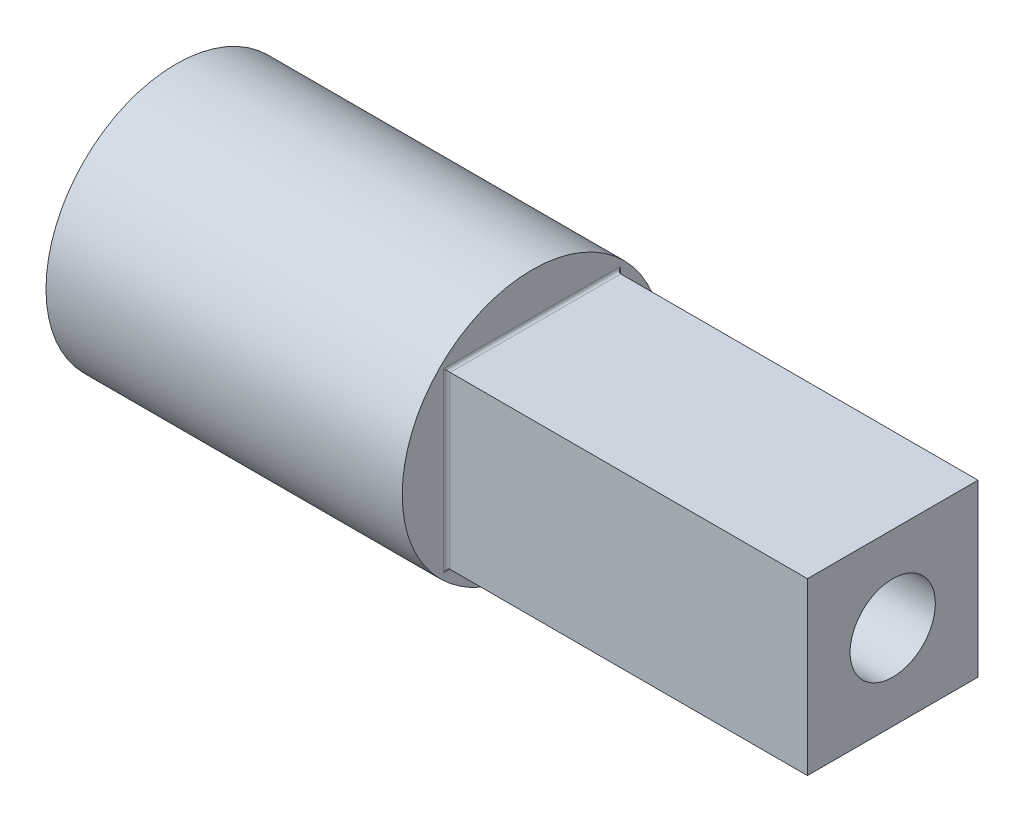
ISO-10303-21;
HEADER;
FILE_DESCRIPTION(('STEP AP214'),'2;1');
FILE_NAME('part.step','',(''),(''),'','','');
FILE_SCHEMA(('AUTOMOTIVE_DESIGN { 1 0 10303 214 1 1 1 1 }'));
ENDSEC;
DATA;
#1=APPLICATION_CONTEXT('core data for automotive mechanical design processes');
#2=APPLICATION_PROTOCOL_DEFINITION('international standard','automotive_design',2000,#1);
#3=PRODUCT_CONTEXT('',#1,'mechanical');
#4=PRODUCT('Part','Part','',(#3));
#5=PRODUCT_RELATED_PRODUCT_CATEGORY('part','',(#4));
#6=PRODUCT_DEFINITION_FORMATION('','',#4);
#7=PRODUCT_DEFINITION_CONTEXT('part definition',#1,'design');
#8=PRODUCT_DEFINITION('design','',#6,#7);
#9=PRODUCT_DEFINITION_SHAPE('','',#8);
#10=(LENGTH_UNIT() NAMED_UNIT(*) SI_UNIT(.MILLI.,.METRE.));
#11=(NAMED_UNIT(*) PLANE_ANGLE_UNIT() SI_UNIT($,.RADIAN.));
#12=(NAMED_UNIT(*) SI_UNIT($,.STERADIAN.) SOLID_ANGLE_UNIT());
#13=UNCERTAINTY_MEASURE_WITH_UNIT(LENGTH_MEASURE(1.E-05),#10,'distance_accuracy_value','');
#14=(GEOMETRIC_REPRESENTATION_CONTEXT(3) GLOBAL_UNCERTAINTY_ASSIGNED_CONTEXT((#13)) GLOBAL_UNIT_ASSIGNED_CONTEXT((#10,
#11,#12)) REPRESENTATION_CONTEXT('',''));
#15=CARTESIAN_POINT('',(0.,0.,0.));
#16=DIRECTION('',(0.,0.,1.));
#17=DIRECTION('',(1.,0.,0.));
#18=AXIS2_PLACEMENT_3D('',#15,#16,#17);
#19=CARTESIAN_POINT('',(87.72,0.,0.));
#20=DIRECTION('',(-1.,0.,0.));
#21=DIRECTION('',(0.,0.,1.));
#22=AXIS2_PLACEMENT_3D('',#19,#20,#21);
#23=CYLINDRICAL_SURFACE('',#22,32.);
#24=CARTESIAN_POINT('',(87.72,0.,0.));
#25=DIRECTION('',(1.,0.,0.));
#26=DIRECTION('',(0.,0.,-1.));
#27=AXIS2_PLACEMENT_3D('',#24,#25,#26);
#28=CIRCLE('',#27,32.);
#29=CARTESIAN_POINT('',(87.72,0.,-32.));
#30=VERTEX_POINT('',#29);
#31=EDGE_CURVE('E121',#30,#30,#28,.T.);
#32=ORIENTED_EDGE('',*,*,#31,.F.);
#33=EDGE_LOOP('',(#32));
#34=FACE_BOUND('',#33,.T.);
#35=CARTESIAN_POINT('',(0.,0.,0.));
#36=DIRECTION('',(1.,0.,0.));
#37=DIRECTION('',(0.,0.,-1.));
#38=AXIS2_PLACEMENT_3D('',#35,#36,#37);
#39=CIRCLE('',#38,32.);
#40=CARTESIAN_POINT('',(0.,0.,-32.));
#41=VERTEX_POINT('',#40);
#42=EDGE_CURVE('E116',#41,#41,#39,.T.);
#43=ORIENTED_EDGE('',*,*,#42,.T.);
#44=EDGE_LOOP('',(#43));
#45=FACE_BOUND('',#44,.T.);
#46=ADVANCED_FACE('F39',(#34,#45),#23,.T.);
#47=CARTESIAN_POINT('',(87.72,0.,0.));
#48=DIRECTION('',(1.,0.,0.));
#49=DIRECTION('',(0.,0.,-1.));
#50=AXIS2_PLACEMENT_3D('',#47,#48,#49);
#51=PLANE('',#50);
#52=DIRECTION('',(0.,0.,1.));
#53=VECTOR('',#52,1.);
#54=CARTESIAN_POINT('',(87.72,21.8,0.));
#55=LINE('',#54,#53);
#56=CARTESIAN_POINT('',(87.72,21.8,21.8));
#57=VERTEX_POINT('',#56);
#58=CARTESIAN_POINT('',(87.72,21.8,-21.8));
#59=VERTEX_POINT('',#58);
#60=EDGE_CURVE('E137',#57,#59,#55,.F.);
#61=ORIENTED_EDGE('',*,*,#60,.T.);
#62=DIRECTION('',(0.,1.,0.));
#63=VECTOR('',#62,1.);
#64=CARTESIAN_POINT('',(87.72,0.,-21.8));
#65=LINE('',#64,#63);
#66=CARTESIAN_POINT('',(87.72,-21.8,-21.8));
#67=VERTEX_POINT('',#66);
#68=EDGE_CURVE('E144',#59,#67,#65,.F.);
#69=ORIENTED_EDGE('',*,*,#68,.T.);
#70=DIRECTION('',(0.,0.,-1.));
#71=VECTOR('',#70,1.);
#72=CARTESIAN_POINT('',(87.72,-21.8,0.));
#73=LINE('',#72,#71);
#74=CARTESIAN_POINT('',(87.72,-21.8,21.8));
#75=VERTEX_POINT('',#74);
#76=EDGE_CURVE('E140',#67,#75,#73,.F.);
#77=ORIENTED_EDGE('',*,*,#76,.T.);
#78=DIRECTION('',(0.,-1.,0.));
#79=VECTOR('',#78,1.);
#80=CARTESIAN_POINT('',(87.72,0.,21.8));
#81=LINE('',#80,#79);
#82=EDGE_CURVE('E134',#75,#57,#81,.F.);
#83=ORIENTED_EDGE('',*,*,#82,.T.);
#84=EDGE_LOOP('',(#61,#69,#77,#83));
#85=FACE_BOUND('',#84,.T.);
#86=ORIENTED_EDGE('',*,*,#31,.T.);
#87=EDGE_LOOP('',(#86));
#88=FACE_BOUND('',#87,.T.);
#89=ADVANCED_FACE('F173',(#85,#88),#51,.T.);
#90=CARTESIAN_POINT('',(0.,0.,0.));
#91=DIRECTION('',(1.,0.,0.));
#92=DIRECTION('',(0.,0.,-1.));
#93=AXIS2_PLACEMENT_3D('',#90,#91,#92);
#94=PLANE('',#93);
#95=ORIENTED_EDGE('',*,*,#42,.F.);
#96=EDGE_LOOP('',(#95));
#97=FACE_BOUND('',#96,.T.);
#98=ADVANCED_FACE('F224',(#97),#94,.F.);
#99=CARTESIAN_POINT('',(176.5,21.,21.));
#100=DIRECTION('',(0.,-1.,0.));
#101=DIRECTION('',(0.,0.,-1.));
#102=AXIS2_PLACEMENT_3D('',#99,#100,#101);
#103=PLANE('',#102);
#104=DIRECTION('',(-1.,0.,0.));
#105=VECTOR('',#104,1.);
#106=CARTESIAN_POINT('',(176.5,21.,-21.));
#107=LINE('',#106,#105);
#108=CARTESIAN_POINT('',(176.5,21.,-21.));
#109=VERTEX_POINT('',#108);
#110=CARTESIAN_POINT('',(88.52,21.,-21.));
#111=VERTEX_POINT('',#110);
#112=EDGE_CURVE('E186',#109,#111,#107,.T.);
#113=ORIENTED_EDGE('',*,*,#112,.T.);
#114=DIRECTION('',(0.,0.,1.));
#115=VECTOR('',#114,1.);
#116=CARTESIAN_POINT('',(88.52,21.,21.));
#117=LINE('',#116,#115);
#118=CARTESIAN_POINT('',(88.52,21.,21.));
#119=VERTEX_POINT('',#118);
#120=EDGE_CURVE('E63',#111,#119,#117,.T.);
#121=ORIENTED_EDGE('',*,*,#120,.T.);
#122=DIRECTION('',(-1.,0.,0.));
#123=VECTOR('',#122,1.);
#124=CARTESIAN_POINT('',(176.5,21.,21.));
#125=LINE('',#124,#123);
#126=CARTESIAN_POINT('',(176.5,21.,21.));
#127=VERTEX_POINT('',#126);
#128=EDGE_CURVE('E98',#127,#119,#125,.T.);
#129=ORIENTED_EDGE('',*,*,#128,.F.);
#130=DIRECTION('',(0.,0.,1.));
#131=VECTOR('',#130,1.);
#132=CARTESIAN_POINT('',(176.5,21.,21.));
#133=LINE('',#132,#131);
#134=EDGE_CURVE('E106',#109,#127,#133,.T.);
#135=ORIENTED_EDGE('',*,*,#134,.F.);
#136=EDGE_LOOP('',(#113,#121,#129,#135));
#137=FACE_BOUND('',#136,.T.);
#138=ADVANCED_FACE('F114',(#137),#103,.F.);
#139=CARTESIAN_POINT('',(176.5,21.,21.));
#140=DIRECTION('',(0.,0.,-1.));
#141=DIRECTION('',(-1.,0.,0.));
#142=AXIS2_PLACEMENT_3D('',#139,#140,#141);
#143=PLANE('',#142);
#144=ORIENTED_EDGE('',*,*,#128,.T.);
#145=DIRECTION('',(0.,-1.,0.));
#146=VECTOR('',#145,1.);
#147=CARTESIAN_POINT('',(88.52,21.,21.));
#148=LINE('',#147,#146);
#149=CARTESIAN_POINT('',(88.52,-21.,21.));
#150=VERTEX_POINT('',#149);
#151=EDGE_CURVE('E11',#119,#150,#148,.T.);
#152=ORIENTED_EDGE('',*,*,#151,.T.);
#153=DIRECTION('',(-1.,0.,0.));
#154=VECTOR('',#153,1.);
#155=CARTESIAN_POINT('',(176.5,-21.,21.));
#156=LINE('',#155,#154);
#157=CARTESIAN_POINT('',(176.5,-21.,21.));
#158=VERTEX_POINT('',#157);
#159=EDGE_CURVE('E101',#158,#150,#156,.T.);
#160=ORIENTED_EDGE('',*,*,#159,.F.);
#161=DIRECTION('',(0.,-1.,0.));
#162=VECTOR('',#161,1.);
#163=CARTESIAN_POINT('',(176.5,21.,21.));
#164=LINE('',#163,#162);
#165=EDGE_CURVE('E95',#127,#158,#164,.T.);
#166=ORIENTED_EDGE('',*,*,#165,.F.);
#167=EDGE_LOOP('',(#144,#152,#160,#166));
#168=FACE_BOUND('',#167,.T.);
#169=ADVANCED_FACE('F97',(#168),#143,.F.);
#170=CARTESIAN_POINT('',(176.5,-21.,21.));
#171=DIRECTION('',(0.,1.,0.));
#172=DIRECTION('',(0.,0.,1.));
#173=AXIS2_PLACEMENT_3D('',#170,#171,#172);
#174=PLANE('',#173);
#175=ORIENTED_EDGE('',*,*,#159,.T.);
#176=DIRECTION('',(0.,0.,-1.));
#177=VECTOR('',#176,1.);
#178=CARTESIAN_POINT('',(88.52,-21.,21.));
#179=LINE('',#178,#177);
#180=CARTESIAN_POINT('',(88.52,-21.,-21.));
#181=VERTEX_POINT('',#180);
#182=EDGE_CURVE('E129',#150,#181,#179,.T.);
#183=ORIENTED_EDGE('',*,*,#182,.T.);
#184=DIRECTION('',(-1.,0.,0.));
#185=VECTOR('',#184,1.);
#186=CARTESIAN_POINT('',(176.5,-21.,-21.));
#187=LINE('',#186,#185);
#188=CARTESIAN_POINT('',(176.5,-21.,-21.));
#189=VERTEX_POINT('',#188);
#190=EDGE_CURVE('E123',#189,#181,#187,.T.);
#191=ORIENTED_EDGE('',*,*,#190,.F.);
#192=DIRECTION('',(0.,0.,-1.));
#193=VECTOR('',#192,1.);
#194=CARTESIAN_POINT('',(176.5,-21.,21.));
#195=LINE('',#194,#193);
#196=EDGE_CURVE('E105',#158,#189,#195,.T.);
#197=ORIENTED_EDGE('',*,*,#196,.F.);
#198=EDGE_LOOP('',(#175,#183,#191,#197));
#199=FACE_BOUND('',#198,.T.);
#200=ADVANCED_FACE('F183',(#199),#174,.F.);
#201=CARTESIAN_POINT('',(176.5,21.,-21.));
#202=DIRECTION('',(0.,0.,1.));
#203=DIRECTION('',(1.,0.,0.));
#204=AXIS2_PLACEMENT_3D('',#201,#202,#203);
#205=PLANE('',#204);
#206=ORIENTED_EDGE('',*,*,#190,.T.);
#207=DIRECTION('',(0.,1.,0.));
#208=VECTOR('',#207,1.);
#209=CARTESIAN_POINT('',(88.52,21.,-21.));
#210=LINE('',#209,#208);
#211=EDGE_CURVE('E49',#181,#111,#210,.T.);
#212=ORIENTED_EDGE('',*,*,#211,.T.);
#213=ORIENTED_EDGE('',*,*,#112,.F.);
#214=DIRECTION('',(0.,1.,0.));
#215=VECTOR('',#214,1.);
#216=CARTESIAN_POINT('',(176.5,21.,-21.));
#217=LINE('',#216,#215);
#218=EDGE_CURVE('E111',#189,#109,#217,.T.);
#219=ORIENTED_EDGE('',*,*,#218,.F.);
#220=EDGE_LOOP('',(#206,#212,#213,#219));
#221=FACE_BOUND('',#220,.T.);
#222=ADVANCED_FACE('F184',(#221),#205,.F.);
#223=CARTESIAN_POINT('',(176.5,0.,0.));
#224=DIRECTION('',(-1.,0.,0.));
#225=DIRECTION('',(0.,0.,1.));
#226=AXIS2_PLACEMENT_3D('',#223,#224,#225);
#227=PLANE('',#226);
#228=CARTESIAN_POINT('',(176.5,0.,0.));
#229=DIRECTION('',(1.,0.,0.));
#230=DIRECTION('',(0.,0.,-1.));
#231=AXIS2_PLACEMENT_3D('',#228,#229,#230);
#232=CIRCLE('',#231,10.5);
#233=CARTESIAN_POINT('',(176.5,0.,-10.5));
#234=VERTEX_POINT('',#233);
#235=EDGE_CURVE('E194',#234,#234,#232,.T.);
#236=ORIENTED_EDGE('',*,*,#235,.F.);
#237=EDGE_LOOP('',(#236));
#238=FACE_BOUND('',#237,.T.);
#239=ORIENTED_EDGE('',*,*,#134,.T.);
#240=ORIENTED_EDGE('',*,*,#165,.T.);
#241=ORIENTED_EDGE('',*,*,#196,.T.);
#242=ORIENTED_EDGE('',*,*,#218,.T.);
#243=EDGE_LOOP('',(#239,#240,#241,#242));
#244=FACE_BOUND('',#243,.T.);
#245=ADVANCED_FACE('F109',(#238,#244),#227,.F.);
#246=CARTESIAN_POINT('',(88.52,21.8,21.));
#247=DIRECTION('',(0.,0.,1.));
#248=DIRECTION('',(1.,0.,0.));
#249=AXIS2_PLACEMENT_3D('',#246,#247,#248);
#250=CYLINDRICAL_SURFACE('',#249,0.8);
#251=CARTESIAN_POINT('',(88.52,21.8,-21.8));
#252=DIRECTION('',(0.,0.707106781186547,0.707106781186547));
#253=DIRECTION('',(0.,0.707106781186547,-0.707106781186547));
#254=AXIS2_PLACEMENT_3D('',#251,#252,#253);
#255=ELLIPSE('',#254,1.13137084989848,0.8);
#256=EDGE_CURVE('E157',#59,#111,#255,.T.);
#257=ORIENTED_EDGE('',*,*,#256,.F.);
#258=ORIENTED_EDGE('',*,*,#60,.F.);
#259=CARTESIAN_POINT('',(88.52,21.8,21.8));
#260=DIRECTION('',(0.,-0.707106781186547,0.707106781186547));
#261=DIRECTION('',(0.,-0.707106781186547,-0.707106781186547));
#262=AXIS2_PLACEMENT_3D('',#259,#260,#261);
#263=ELLIPSE('',#262,1.13137084989848,0.8);
#264=EDGE_CURVE('E43',#119,#57,#263,.F.);
#265=ORIENTED_EDGE('',*,*,#264,.F.);
#266=ORIENTED_EDGE('',*,*,#120,.F.);
#267=EDGE_LOOP('',(#257,#258,#265,#266));
#268=FACE_BOUND('',#267,.T.);
#269=ADVANCED_FACE('F41',(#268),#250,.F.);
#270=CARTESIAN_POINT('',(88.52,21.,21.8));
#271=DIRECTION('',(0.,-1.,0.));
#272=DIRECTION('',(0.,0.,-1.));
#273=AXIS2_PLACEMENT_3D('',#270,#271,#272);
#274=CYLINDRICAL_SURFACE('',#273,0.8);
#275=ORIENTED_EDGE('',*,*,#264,.T.);
#276=ORIENTED_EDGE('',*,*,#82,.F.);
#277=CARTESIAN_POINT('',(88.52,-21.8,21.8));
#278=DIRECTION('',(0.,-0.707106781186547,-0.707106781186547));
#279=DIRECTION('',(0.,-0.707106781186547,0.707106781186547));
#280=AXIS2_PLACEMENT_3D('',#277,#278,#279);
#281=ELLIPSE('',#280,1.13137084989848,0.8);
#282=EDGE_CURVE('E154',#150,#75,#281,.F.);
#283=ORIENTED_EDGE('',*,*,#282,.F.);
#284=ORIENTED_EDGE('',*,*,#151,.F.);
#285=EDGE_LOOP('',(#275,#276,#283,#284));
#286=FACE_BOUND('',#285,.T.);
#287=ADVANCED_FACE('F168',(#286),#274,.F.);
#288=CARTESIAN_POINT('',(88.52,21.,-21.8));
#289=DIRECTION('',(0.,1.,0.));
#290=DIRECTION('',(0.,0.,1.));
#291=AXIS2_PLACEMENT_3D('',#288,#289,#290);
#292=CYLINDRICAL_SURFACE('',#291,0.8);
#293=ORIENTED_EDGE('',*,*,#256,.T.);
#294=ORIENTED_EDGE('',*,*,#211,.F.);
#295=CARTESIAN_POINT('',(88.52,-21.8,-21.8));
#296=DIRECTION('',(0.,0.707106781186547,-0.707106781186547));
#297=DIRECTION('',(0.,0.707106781186547,0.707106781186547));
#298=AXIS2_PLACEMENT_3D('',#295,#296,#297);
#299=ELLIPSE('',#298,1.13137084989848,0.8);
#300=EDGE_CURVE('E151',#67,#181,#299,.T.);
#301=ORIENTED_EDGE('',*,*,#300,.F.);
#302=ORIENTED_EDGE('',*,*,#68,.F.);
#303=EDGE_LOOP('',(#293,#294,#301,#302));
#304=FACE_BOUND('',#303,.T.);
#305=ADVANCED_FACE('F180',(#304),#292,.F.);
#306=CARTESIAN_POINT('',(88.52,-21.8,21.));
#307=DIRECTION('',(0.,0.,-1.));
#308=DIRECTION('',(-1.,0.,0.));
#309=AXIS2_PLACEMENT_3D('',#306,#307,#308);
#310=CYLINDRICAL_SURFACE('',#309,0.8);
#311=ORIENTED_EDGE('',*,*,#282,.T.);
#312=ORIENTED_EDGE('',*,*,#76,.F.);
#313=ORIENTED_EDGE('',*,*,#300,.T.);
#314=ORIENTED_EDGE('',*,*,#182,.F.);
#315=EDGE_LOOP('',(#311,#312,#313,#314));
#316=FACE_BOUND('',#315,.T.);
#317=ADVANCED_FACE('F178',(#316),#310,.F.);
#318=CARTESIAN_POINT('',(160.5,0.,0.));
#319=DIRECTION('',(1.,0.,0.));
#320=DIRECTION('',(0.,0.,-1.));
#321=AXIS2_PLACEMENT_3D('',#318,#319,#320);
#322=CYLINDRICAL_SURFACE('',#321,10.5);
#323=CARTESIAN_POINT('',(160.5,0.,0.));
#324=DIRECTION('',(1.,0.,0.));
#325=DIRECTION('',(0.,0.,-1.));
#326=AXIS2_PLACEMENT_3D('',#323,#324,#325);
#327=CIRCLE('',#326,10.5);
#328=CARTESIAN_POINT('',(160.5,0.,-10.5));
#329=VERTEX_POINT('',#328);
#330=EDGE_CURVE('E155',#329,#329,#327,.T.);
#331=ORIENTED_EDGE('',*,*,#330,.F.);
#332=EDGE_LOOP('',(#331));
#333=FACE_BOUND('',#332,.T.);
#334=ORIENTED_EDGE('',*,*,#235,.T.);
#335=EDGE_LOOP('',(#334));
#336=FACE_BOUND('',#335,.T.);
#337=ADVANCED_FACE('F204',(#333,#336),#322,.F.);
#338=CARTESIAN_POINT('',(160.5,0.,0.));
#339=DIRECTION('',(1.,0.,0.));
#340=DIRECTION('',(0.,0.,-1.));
#341=AXIS2_PLACEMENT_3D('',#338,#339,#340);
#342=PLANE('',#341);
#343=ORIENTED_EDGE('',*,*,#330,.T.);
#344=EDGE_LOOP('',(#343));
#345=FACE_BOUND('',#344,.T.);
#346=ADVANCED_FACE('F202',(#345),#342,.T.);
#347=CLOSED_SHELL('',(#46,#89,#98,#138,#169,#200,#222,#245,#269,#287,#305,#317,#337,#346));
#348=MANIFOLD_SOLID_BREP('B2',#347);
#349=ADVANCED_BREP_SHAPE_REPRESENTATION('',(#18,#348),#14);
#350=SHAPE_DEFINITION_REPRESENTATION(#9,#349);
ENDSEC;
END-ISO-10303-21;
